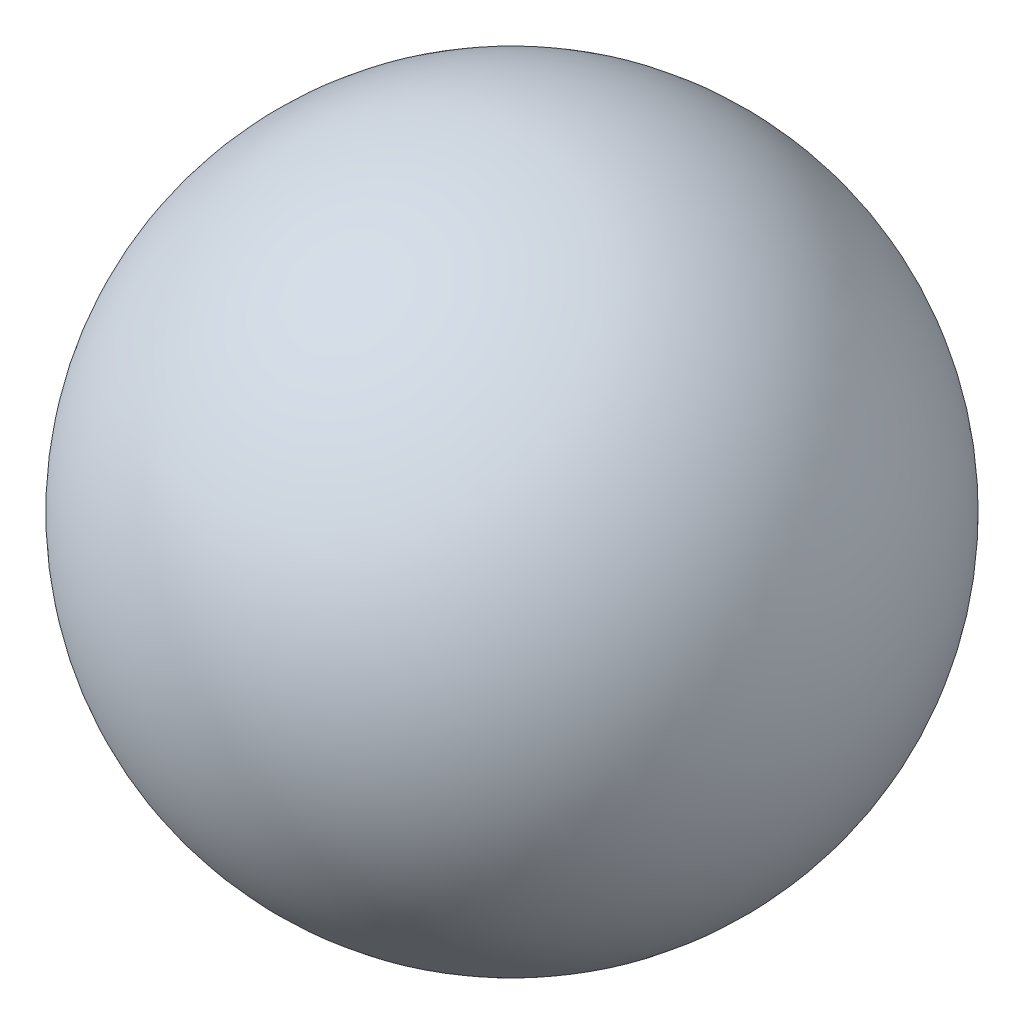
ISO-10303-21;
HEADER;
FILE_DESCRIPTION(('STEP AP214'),'2;1');
FILE_NAME('part.step','',(''),(''),'','','');
FILE_SCHEMA(('AUTOMOTIVE_DESIGN { 1 0 10303 214 1 1 1 1 }'));
ENDSEC;
DATA;
#1=APPLICATION_CONTEXT('core data for automotive mechanical design processes');
#2=APPLICATION_PROTOCOL_DEFINITION('international standard','automotive_design',2000,#1);
#3=PRODUCT_CONTEXT('',#1,'mechanical');
#4=PRODUCT('Part','Part','',(#3));
#5=PRODUCT_RELATED_PRODUCT_CATEGORY('part','',(#4));
#6=PRODUCT_DEFINITION_FORMATION('','',#4);
#7=PRODUCT_DEFINITION_CONTEXT('part definition',#1,'design');
#8=PRODUCT_DEFINITION('design','',#6,#7);
#9=PRODUCT_DEFINITION_SHAPE('','',#8);
#10=(LENGTH_UNIT() NAMED_UNIT(*) SI_UNIT(.MILLI.,.METRE.));
#11=(NAMED_UNIT(*) PLANE_ANGLE_UNIT() SI_UNIT($,.RADIAN.));
#12=(NAMED_UNIT(*) SI_UNIT($,.STERADIAN.) SOLID_ANGLE_UNIT());
#13=UNCERTAINTY_MEASURE_WITH_UNIT(LENGTH_MEASURE(1.E-05),#10,'distance_accuracy_value','');
#14=(GEOMETRIC_REPRESENTATION_CONTEXT(3) GLOBAL_UNCERTAINTY_ASSIGNED_CONTEXT((#13)) GLOBAL_UNIT_ASSIGNED_CONTEXT((#10,
#11,#12)) REPRESENTATION_CONTEXT('',''));
#15=CARTESIAN_POINT('',(0.,0.,0.));
#16=DIRECTION('',(0.,0.,1.));
#17=DIRECTION('',(1.,0.,0.));
#18=AXIS2_PLACEMENT_3D('',#15,#16,#17);
#19=CARTESIAN_POINT('',(-2.69803214092825,23.299335331709,37.3051474186283));
#20=DIRECTION('',(0.,1.,0.));
#21=DIRECTION('',(0.,0.,1.));
#22=AXIS2_PLACEMENT_3D('',#19,#20,#21);
#23=SPHERICAL_SURFACE('',#22,28.5);
#24=CARTESIAN_POINT('',(-2.69803214092824,51.799335331709,37.3051474186281));
#25=VERTEX_POINT('',#24);
#26=VERTEX_LOOP('',#25);
#27=FACE_BOUND('',#26,.T.);
#28=ADVANCED_FACE('F35',(#27),#23,.T.);
#29=CLOSED_SHELL('',(#28));
#30=MANIFOLD_SOLID_BREP('B2',#29);
#31=ADVANCED_BREP_SHAPE_REPRESENTATION('',(#18,#30),#14);
#32=SHAPE_DEFINITION_REPRESENTATION(#9,#31);
ENDSEC;
END-ISO-10303-21;
